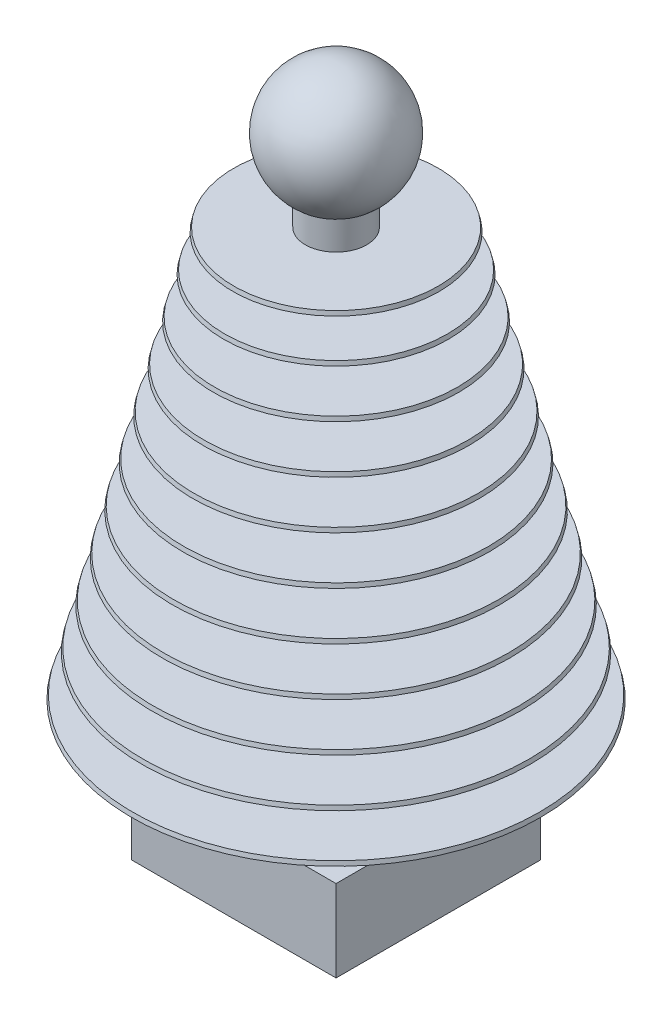
ISO-10303-21;
HEADER;
FILE_DESCRIPTION(('STEP AP214'),'2;1');
FILE_NAME('part.step','',(''),(''),'','','');
FILE_SCHEMA(('AUTOMOTIVE_DESIGN { 1 0 10303 214 1 1 1 1 }'));
ENDSEC;
DATA;
#1=APPLICATION_CONTEXT('core data for automotive mechanical design processes');
#2=APPLICATION_PROTOCOL_DEFINITION('international standard','automotive_design',2000,#1);
#3=PRODUCT_CONTEXT('',#1,'mechanical');
#4=PRODUCT('Part','Part','',(#3));
#5=PRODUCT_RELATED_PRODUCT_CATEGORY('part','',(#4));
#6=PRODUCT_DEFINITION_FORMATION('','',#4);
#7=PRODUCT_DEFINITION_CONTEXT('part definition',#1,'design');
#8=PRODUCT_DEFINITION('design','',#6,#7);
#9=PRODUCT_DEFINITION_SHAPE('','',#8);
#10=(LENGTH_UNIT() NAMED_UNIT(*) SI_UNIT(.MILLI.,.METRE.));
#11=(NAMED_UNIT(*) PLANE_ANGLE_UNIT() SI_UNIT($,.RADIAN.));
#12=(NAMED_UNIT(*) SI_UNIT($,.STERADIAN.) SOLID_ANGLE_UNIT());
#13=UNCERTAINTY_MEASURE_WITH_UNIT(LENGTH_MEASURE(1.E-05),#10,'distance_accuracy_value','');
#14=(GEOMETRIC_REPRESENTATION_CONTEXT(3) GLOBAL_UNCERTAINTY_ASSIGNED_CONTEXT((#13)) GLOBAL_UNIT_ASSIGNED_CONTEXT((#10,
#11,#12)) REPRESENTATION_CONTEXT('',''));
#15=CARTESIAN_POINT('',(0.,0.,0.));
#16=DIRECTION('',(0.,0.,1.));
#17=DIRECTION('',(1.,0.,0.));
#18=AXIS2_PLACEMENT_3D('',#15,#16,#17);
#19=CARTESIAN_POINT('',(0.,-64.,0.));
#20=DIRECTION('',(0.,1.,0.));
#21=DIRECTION('',(-1.,0.,0.));
#22=AXIS2_PLACEMENT_3D('',#19,#20,#21);
#23=CYLINDRICAL_SURFACE('',#22,7.5);
#24=CARTESIAN_POINT('',(0.,40.,0.));
#25=DIRECTION('',(0.,-1.,0.));
#26=DIRECTION('',(1.,0.,0.));
#27=AXIS2_PLACEMENT_3D('',#24,#25,#26);
#28=CIRCLE('',#27,7.5);
#29=CARTESIAN_POINT('',(7.49999999999999,40.,0.));
#30=VERTEX_POINT('',#29);
#31=EDGE_CURVE('E51',#30,#30,#28,.F.);
#32=ORIENTED_EDGE('',*,*,#31,.F.);
#33=EDGE_LOOP('',(#32));
#34=FACE_BOUND('',#33,.T.);
#35=CARTESIAN_POINT('',(0.,31.,0.));
#36=DIRECTION('',(0.,1.,0.));
#37=DIRECTION('',(-1.,0.,0.));
#38=AXIS2_PLACEMENT_3D('',#35,#36,#37);
#39=CIRCLE('',#38,7.5);
#40=CARTESIAN_POINT('',(-7.50000000000001,31.,0.));
#41=VERTEX_POINT('',#40);
#42=EDGE_CURVE('E286',#41,#41,#39,.F.);
#43=ORIENTED_EDGE('',*,*,#42,.F.);
#44=EDGE_LOOP('',(#43));
#45=FACE_BOUND('',#44,.T.);
#46=ADVANCED_FACE('F41',(#34,#45),#23,.T.);
#47=CARTESIAN_POINT('',(0.,20.,0.));
#48=DIRECTION('',(0.,-1.,0.));
#49=DIRECTION('',(1.,0.,0.));
#50=AXIS2_PLACEMENT_3D('',#47,#48,#49);
#51=CIRCLE('',#50,7.5);
#52=CARTESIAN_POINT('',(7.5,20.,0.));
#53=VERTEX_POINT('',#52);
#54=EDGE_CURVE('E294',#53,#53,#51,.F.);
#55=ORIENTED_EDGE('',*,*,#54,.F.);
#56=EDGE_LOOP('',(#55));
#57=FACE_BOUND('',#56,.T.);
#58=CARTESIAN_POINT('',(0.,11.,0.));
#59=DIRECTION('',(0.,1.,0.));
#60=DIRECTION('',(-1.,0.,0.));
#61=AXIS2_PLACEMENT_3D('',#58,#59,#60);
#62=CIRCLE('',#61,7.5);
#63=CARTESIAN_POINT('',(-7.5,11.,0.));
#64=VERTEX_POINT('',#63);
#65=EDGE_CURVE('E278',#64,#64,#62,.F.);
#66=ORIENTED_EDGE('',*,*,#65,.F.);
#67=EDGE_LOOP('',(#66));
#68=FACE_BOUND('',#67,.T.);
#69=ADVANCED_FACE('F314',(#57,#68),#23,.T.);
#70=CARTESIAN_POINT('',(0.,10.,0.));
#71=DIRECTION('',(0.,-1.,0.));
#72=DIRECTION('',(1.,0.,0.));
#73=AXIS2_PLACEMENT_3D('',#70,#71,#72);
#74=CIRCLE('',#73,7.5);
#75=CARTESIAN_POINT('',(7.5,10.,0.));
#76=VERTEX_POINT('',#75);
#77=EDGE_CURVE('E282',#76,#76,#74,.F.);
#78=ORIENTED_EDGE('',*,*,#77,.F.);
#79=EDGE_LOOP('',(#78));
#80=FACE_BOUND('',#79,.T.);
#81=CARTESIAN_POINT('',(0.,1.,0.));
#82=DIRECTION('',(0.,1.,0.));
#83=DIRECTION('',(-1.,0.,0.));
#84=AXIS2_PLACEMENT_3D('',#81,#82,#83);
#85=CIRCLE('',#84,7.5);
#86=CARTESIAN_POINT('',(-7.5,1.,0.));
#87=VERTEX_POINT('',#86);
#88=EDGE_CURVE('E270',#87,#87,#85,.F.);
#89=ORIENTED_EDGE('',*,*,#88,.F.);
#90=EDGE_LOOP('',(#89));
#91=FACE_BOUND('',#90,.T.);
#92=ADVANCED_FACE('F521',(#80,#91),#23,.T.);
#93=CARTESIAN_POINT('',(0.,0.,0.));
#94=DIRECTION('',(0.,-1.,0.));
#95=DIRECTION('',(1.,0.,0.));
#96=AXIS2_PLACEMENT_3D('',#93,#94,#95);
#97=CIRCLE('',#96,7.5);
#98=CARTESIAN_POINT('',(7.5,0.,0.));
#99=VERTEX_POINT('',#98);
#100=EDGE_CURVE('E274',#99,#99,#97,.F.);
#101=ORIENTED_EDGE('',*,*,#100,.F.);
#102=EDGE_LOOP('',(#101));
#103=FACE_BOUND('',#102,.T.);
#104=CARTESIAN_POINT('',(0.,-9.00000000000001,0.));
#105=DIRECTION('',(0.,1.,0.));
#106=DIRECTION('',(-1.,0.,0.));
#107=AXIS2_PLACEMENT_3D('',#104,#105,#106);
#108=CIRCLE('',#107,7.5);
#109=CARTESIAN_POINT('',(-7.5,-9.00000000000001,0.));
#110=VERTEX_POINT('',#109);
#111=EDGE_CURVE('E262',#110,#110,#108,.F.);
#112=ORIENTED_EDGE('',*,*,#111,.F.);
#113=EDGE_LOOP('',(#112));
#114=FACE_BOUND('',#113,.T.);
#115=ADVANCED_FACE('F508',(#103,#114),#23,.T.);
#116=CARTESIAN_POINT('',(0.,-10.,0.));
#117=DIRECTION('',(0.,-1.,0.));
#118=DIRECTION('',(1.,0.,0.));
#119=AXIS2_PLACEMENT_3D('',#116,#117,#118);
#120=CIRCLE('',#119,7.5);
#121=CARTESIAN_POINT('',(7.5,-10.,0.));
#122=VERTEX_POINT('',#121);
#123=EDGE_CURVE('E266',#122,#122,#120,.F.);
#124=ORIENTED_EDGE('',*,*,#123,.F.);
#125=EDGE_LOOP('',(#124));
#126=FACE_BOUND('',#125,.T.);
#127=CARTESIAN_POINT('',(0.,-19.,0.));
#128=DIRECTION('',(0.,1.,0.));
#129=DIRECTION('',(-1.,0.,0.));
#130=AXIS2_PLACEMENT_3D('',#127,#128,#129);
#131=CIRCLE('',#130,7.5);
#132=CARTESIAN_POINT('',(-7.5,-19.,0.));
#133=VERTEX_POINT('',#132);
#134=EDGE_CURVE('E254',#133,#133,#131,.F.);
#135=ORIENTED_EDGE('',*,*,#134,.F.);
#136=EDGE_LOOP('',(#135));
#137=FACE_BOUND('',#136,.T.);
#138=ADVANCED_FACE('F495',(#126,#137),#23,.T.);
#139=CARTESIAN_POINT('',(0.,-20.,0.));
#140=DIRECTION('',(0.,-1.,0.));
#141=DIRECTION('',(1.,0.,0.));
#142=AXIS2_PLACEMENT_3D('',#139,#140,#141);
#143=CIRCLE('',#142,7.5);
#144=CARTESIAN_POINT('',(7.5,-20.,0.));
#145=VERTEX_POINT('',#144);
#146=EDGE_CURVE('E258',#145,#145,#143,.F.);
#147=ORIENTED_EDGE('',*,*,#146,.F.);
#148=EDGE_LOOP('',(#147));
#149=FACE_BOUND('',#148,.T.);
#150=CARTESIAN_POINT('',(0.,-29.,0.));
#151=DIRECTION('',(0.,1.,0.));
#152=DIRECTION('',(-1.,0.,0.));
#153=AXIS2_PLACEMENT_3D('',#150,#151,#152);
#154=CIRCLE('',#153,7.5);
#155=CARTESIAN_POINT('',(-7.49999999999999,-29.,0.));
#156=VERTEX_POINT('',#155);
#157=EDGE_CURVE('E246',#156,#156,#154,.F.);
#158=ORIENTED_EDGE('',*,*,#157,.F.);
#159=EDGE_LOOP('',(#158));
#160=FACE_BOUND('',#159,.T.);
#161=ADVANCED_FACE('F479',(#149,#160),#23,.T.);
#162=CARTESIAN_POINT('',(0.,-30.,0.));
#163=DIRECTION('',(0.,-1.,0.));
#164=DIRECTION('',(1.,0.,0.));
#165=AXIS2_PLACEMENT_3D('',#162,#163,#164);
#166=CIRCLE('',#165,7.5);
#167=CARTESIAN_POINT('',(7.50000000000001,-30.,0.));
#168=VERTEX_POINT('',#167);
#169=EDGE_CURVE('E250',#168,#168,#166,.F.);
#170=ORIENTED_EDGE('',*,*,#169,.F.);
#171=EDGE_LOOP('',(#170));
#172=FACE_BOUND('',#171,.T.);
#173=CARTESIAN_POINT('',(0.,-39.,0.));
#174=DIRECTION('',(0.,1.,0.));
#175=DIRECTION('',(-1.,0.,0.));
#176=AXIS2_PLACEMENT_3D('',#173,#174,#175);
#177=CIRCLE('',#176,7.5);
#178=CARTESIAN_POINT('',(-7.49999999999999,-39.,0.));
#179=VERTEX_POINT('',#178);
#180=EDGE_CURVE('E238',#179,#179,#177,.F.);
#181=ORIENTED_EDGE('',*,*,#180,.F.);
#182=EDGE_LOOP('',(#181));
#183=FACE_BOUND('',#182,.T.);
#184=ADVANCED_FACE('F474',(#172,#183),#23,.T.);
#185=CARTESIAN_POINT('',(0.,-40.,0.));
#186=DIRECTION('',(0.,-1.,0.));
#187=DIRECTION('',(1.,0.,0.));
#188=AXIS2_PLACEMENT_3D('',#185,#186,#187);
#189=CIRCLE('',#188,7.5);
#190=CARTESIAN_POINT('',(7.50000000000001,-40.,0.));
#191=VERTEX_POINT('',#190);
#192=EDGE_CURVE('E242',#191,#191,#189,.F.);
#193=ORIENTED_EDGE('',*,*,#192,.F.);
#194=EDGE_LOOP('',(#193));
#195=FACE_BOUND('',#194,.T.);
#196=CARTESIAN_POINT('',(0.,-49.,0.));
#197=DIRECTION('',(0.,1.,0.));
#198=DIRECTION('',(-1.,0.,0.));
#199=AXIS2_PLACEMENT_3D('',#196,#197,#198);
#200=CIRCLE('',#199,7.5);
#201=CARTESIAN_POINT('',(-7.49999999999999,-49.,0.));
#202=VERTEX_POINT('',#201);
#203=EDGE_CURVE('E234',#202,#202,#200,.F.);
#204=ORIENTED_EDGE('',*,*,#203,.F.);
#205=EDGE_LOOP('',(#204));
#206=FACE_BOUND('',#205,.T.);
#207=ADVANCED_FACE('F427',(#195,#206),#23,.T.);
#208=CARTESIAN_POINT('',(0.,-49.,0.));
#209=DIRECTION('',(0.,1.,0.));
#210=DIRECTION('',(-1.,0.,0.));
#211=AXIS2_PLACEMENT_3D('',#208,#209,#210);
#212=PLANE('',#211);
#213=ORIENTED_EDGE('',*,*,#203,.T.);
#214=EDGE_LOOP('',(#213));
#215=FACE_BOUND('',#214,.T.);
#216=CARTESIAN_POINT('',(0.,-49.,0.));
#217=DIRECTION('',(0.,-1.,0.));
#218=DIRECTION('',(1.,0.,0.));
#219=AXIS2_PLACEMENT_3D('',#216,#217,#218);
#220=CIRCLE('',#219,49.75);
#221=CARTESIAN_POINT('',(49.75,-49.,0.));
#222=VERTEX_POINT('',#221);
#223=EDGE_CURVE('E207',#222,#222,#220,.T.);
#224=ORIENTED_EDGE('',*,*,#223,.F.);
#225=EDGE_LOOP('',(#224));
#226=FACE_BOUND('',#225,.T.);
#227=ADVANCED_FACE('F424',(#215,#226),#212,.T.);
#228=CARTESIAN_POINT('',(0.,-50.,0.));
#229=DIRECTION('',(0.,-1.,0.));
#230=DIRECTION('',(1.,0.,0.));
#231=AXIS2_PLACEMENT_3D('',#228,#229,#230);
#232=CONICAL_SURFACE('',#231,50.,0.244978663126849);
#233=ORIENTED_EDGE('',*,*,#223,.T.);
#234=EDGE_LOOP('',(#233));
#235=FACE_BOUND('',#234,.T.);
#236=CARTESIAN_POINT('',(0.,-50.,0.));
#237=DIRECTION('',(0.,-1.,0.));
#238=DIRECTION('',(1.,0.,0.));
#239=AXIS2_PLACEMENT_3D('',#236,#237,#238);
#240=CIRCLE('',#239,50.);
#241=CARTESIAN_POINT('',(50.,-50.,0.));
#242=VERTEX_POINT('',#241);
#243=EDGE_CURVE('E203',#242,#242,#240,.T.);
#244=ORIENTED_EDGE('',*,*,#243,.F.);
#245=EDGE_LOOP('',(#244));
#246=FACE_BOUND('',#245,.T.);
#247=ADVANCED_FACE('F420',(#235,#246),#232,.T.);
#248=CARTESIAN_POINT('',(50.,-50.,0.));
#249=DIRECTION('',(0.,-1.,0.));
#250=DIRECTION('',(1.,0.,0.));
#251=AXIS2_PLACEMENT_3D('',#248,#249,#250);
#252=PLANE('',#251);
#253=CARTESIAN_POINT('',(0.,-50.,0.));
#254=DIRECTION('',(0.,-1.,0.));
#255=DIRECTION('',(1.,0.,0.));
#256=AXIS2_PLACEMENT_3D('',#253,#254,#255);
#257=CIRCLE('',#256,7.5);
#258=CARTESIAN_POINT('',(7.50000000000001,-50.,0.));
#259=VERTEX_POINT('',#258);
#260=EDGE_CURVE('E219',#259,#259,#257,.F.);
#261=ORIENTED_EDGE('',*,*,#260,.T.);
#262=EDGE_LOOP('',(#261));
#263=FACE_BOUND('',#262,.T.);
#264=ORIENTED_EDGE('',*,*,#243,.T.);
#265=EDGE_LOOP('',(#264));
#266=FACE_BOUND('',#265,.T.);
#267=ADVANCED_FACE('F417',(#263,#266),#252,.T.);
#268=ORIENTED_EDGE('',*,*,#260,.F.);
#269=EDGE_LOOP('',(#268));
#270=FACE_BOUND('',#269,.T.);
#271=CARTESIAN_POINT('',(0.,-64.,0.));
#272=DIRECTION('',(0.,1.,0.));
#273=DIRECTION('',(-1.,0.,0.));
#274=AXIS2_PLACEMENT_3D('',#271,#272,#273);
#275=CIRCLE('',#274,7.5);
#276=CARTESIAN_POINT('',(-7.49999999999999,-64.,0.));
#277=VERTEX_POINT('',#276);
#278=EDGE_CURVE('E130',#277,#277,#275,.T.);
#279=ORIENTED_EDGE('',*,*,#278,.T.);
#280=EDGE_LOOP('',(#279));
#281=FACE_BOUND('',#280,.T.);
#282=ADVANCED_FACE('F317',(#270,#281),#23,.T.);
#283=CARTESIAN_POINT('',(0.,-40.,0.));
#284=DIRECTION('',(0.,-1.,0.));
#285=DIRECTION('',(1.,0.,0.));
#286=AXIS2_PLACEMENT_3D('',#283,#284,#285);
#287=CONICAL_SURFACE('',#286,47.5,0.244978663126863);
#288=CARTESIAN_POINT('',(0.,-39.,0.));
#289=DIRECTION('',(0.,-1.,0.));
#290=DIRECTION('',(1.,0.,0.));
#291=AXIS2_PLACEMENT_3D('',#288,#289,#290);
#292=CIRCLE('',#291,47.25);
#293=CARTESIAN_POINT('',(47.25,-39.,0.));
#294=VERTEX_POINT('',#293);
#295=EDGE_CURVE('E195',#294,#294,#292,.T.);
#296=ORIENTED_EDGE('',*,*,#295,.T.);
#297=EDGE_LOOP('',(#296));
#298=FACE_BOUND('',#297,.T.);
#299=CARTESIAN_POINT('',(0.,-40.,0.));
#300=DIRECTION('',(0.,-1.,0.));
#301=DIRECTION('',(1.,0.,0.));
#302=AXIS2_PLACEMENT_3D('',#299,#300,#301);
#303=CIRCLE('',#302,47.5);
#304=CARTESIAN_POINT('',(47.5,-40.,0.));
#305=VERTEX_POINT('',#304);
#306=EDGE_CURVE('E199',#305,#305,#303,.T.);
#307=ORIENTED_EDGE('',*,*,#306,.F.);
#308=EDGE_LOOP('',(#307));
#309=FACE_BOUND('',#308,.T.);
#310=ADVANCED_FACE('F412',(#298,#309),#287,.T.);
#311=CARTESIAN_POINT('',(47.5,-40.,0.));
#312=DIRECTION('',(0.,-1.,0.));
#313=DIRECTION('',(1.,0.,0.));
#314=AXIS2_PLACEMENT_3D('',#311,#312,#313);
#315=PLANE('',#314);
#316=ORIENTED_EDGE('',*,*,#192,.T.);
#317=EDGE_LOOP('',(#316));
#318=FACE_BOUND('',#317,.T.);
#319=ORIENTED_EDGE('',*,*,#306,.T.);
#320=EDGE_LOOP('',(#319));
#321=FACE_BOUND('',#320,.T.);
#322=ADVANCED_FACE('F408',(#318,#321),#315,.T.);
#323=CARTESIAN_POINT('',(0.,-39.,0.));
#324=DIRECTION('',(0.,1.,0.));
#325=DIRECTION('',(-1.,0.,0.));
#326=AXIS2_PLACEMENT_3D('',#323,#324,#325);
#327=PLANE('',#326);
#328=ORIENTED_EDGE('',*,*,#180,.T.);
#329=EDGE_LOOP('',(#328));
#330=FACE_BOUND('',#329,.T.);
#331=ORIENTED_EDGE('',*,*,#295,.F.);
#332=EDGE_LOOP('',(#331));
#333=FACE_BOUND('',#332,.T.);
#334=ADVANCED_FACE('F404',(#330,#333),#327,.T.);
#335=CARTESIAN_POINT('',(0.,-30.,0.));
#336=DIRECTION('',(0.,-1.,0.));
#337=DIRECTION('',(1.,0.,0.));
#338=AXIS2_PLACEMENT_3D('',#335,#336,#337);
#339=CONICAL_SURFACE('',#338,45.,0.244978663126863);
#340=CARTESIAN_POINT('',(0.,-29.,0.));
#341=DIRECTION('',(0.,-1.,0.));
#342=DIRECTION('',(1.,0.,0.));
#343=AXIS2_PLACEMENT_3D('',#340,#341,#342);
#344=CIRCLE('',#343,44.75);
#345=CARTESIAN_POINT('',(44.75,-29.,0.));
#346=VERTEX_POINT('',#345);
#347=EDGE_CURVE('E187',#346,#346,#344,.T.);
#348=ORIENTED_EDGE('',*,*,#347,.T.);
#349=EDGE_LOOP('',(#348));
#350=FACE_BOUND('',#349,.T.);
#351=CARTESIAN_POINT('',(0.,-30.,0.));
#352=DIRECTION('',(0.,-1.,0.));
#353=DIRECTION('',(1.,0.,0.));
#354=AXIS2_PLACEMENT_3D('',#351,#352,#353);
#355=CIRCLE('',#354,45.);
#356=CARTESIAN_POINT('',(45.,-30.,0.));
#357=VERTEX_POINT('',#356);
#358=EDGE_CURVE('E191',#357,#357,#355,.T.);
#359=ORIENTED_EDGE('',*,*,#358,.F.);
#360=EDGE_LOOP('',(#359));
#361=FACE_BOUND('',#360,.T.);
#362=ADVANCED_FACE('F400',(#350,#361),#339,.T.);
#363=CARTESIAN_POINT('',(45.,-30.,0.));
#364=DIRECTION('',(0.,-1.,0.));
#365=DIRECTION('',(1.,0.,0.));
#366=AXIS2_PLACEMENT_3D('',#363,#364,#365);
#367=PLANE('',#366);
#368=ORIENTED_EDGE('',*,*,#169,.T.);
#369=EDGE_LOOP('',(#368));
#370=FACE_BOUND('',#369,.T.);
#371=ORIENTED_EDGE('',*,*,#358,.T.);
#372=EDGE_LOOP('',(#371));
#373=FACE_BOUND('',#372,.T.);
#374=ADVANCED_FACE('F396',(#370,#373),#367,.T.);
#375=CARTESIAN_POINT('',(0.,-29.,0.));
#376=DIRECTION('',(0.,1.,0.));
#377=DIRECTION('',(-1.,0.,0.));
#378=AXIS2_PLACEMENT_3D('',#375,#376,#377);
#379=PLANE('',#378);
#380=ORIENTED_EDGE('',*,*,#157,.T.);
#381=EDGE_LOOP('',(#380));
#382=FACE_BOUND('',#381,.T.);
#383=ORIENTED_EDGE('',*,*,#347,.F.);
#384=EDGE_LOOP('',(#383));
#385=FACE_BOUND('',#384,.T.);
#386=ADVANCED_FACE('F392',(#382,#385),#379,.T.);
#387=CARTESIAN_POINT('',(0.,-20.,0.));
#388=DIRECTION('',(0.,-1.,0.));
#389=DIRECTION('',(1.,0.,0.));
#390=AXIS2_PLACEMENT_3D('',#387,#388,#389);
#391=CONICAL_SURFACE('',#390,42.5,0.244978663126864);
#392=CARTESIAN_POINT('',(0.,-19.,0.));
#393=DIRECTION('',(0.,-1.,0.));
#394=DIRECTION('',(1.,0.,0.));
#395=AXIS2_PLACEMENT_3D('',#392,#393,#394);
#396=CIRCLE('',#395,42.25);
#397=CARTESIAN_POINT('',(42.25,-19.,0.));
#398=VERTEX_POINT('',#397);
#399=EDGE_CURVE('E179',#398,#398,#396,.T.);
#400=ORIENTED_EDGE('',*,*,#399,.T.);
#401=EDGE_LOOP('',(#400));
#402=FACE_BOUND('',#401,.T.);
#403=CARTESIAN_POINT('',(0.,-20.,0.));
#404=DIRECTION('',(0.,-1.,0.));
#405=DIRECTION('',(1.,0.,0.));
#406=AXIS2_PLACEMENT_3D('',#403,#404,#405);
#407=CIRCLE('',#406,42.5);
#408=CARTESIAN_POINT('',(42.5,-20.,0.));
#409=VERTEX_POINT('',#408);
#410=EDGE_CURVE('E183',#409,#409,#407,.T.);
#411=ORIENTED_EDGE('',*,*,#410,.F.);
#412=EDGE_LOOP('',(#411));
#413=FACE_BOUND('',#412,.T.);
#414=ADVANCED_FACE('F388',(#402,#413),#391,.T.);
#415=CARTESIAN_POINT('',(42.5,-20.,0.));
#416=DIRECTION('',(0.,-1.,0.));
#417=DIRECTION('',(1.,0.,0.));
#418=AXIS2_PLACEMENT_3D('',#415,#416,#417);
#419=PLANE('',#418);
#420=ORIENTED_EDGE('',*,*,#146,.T.);
#421=EDGE_LOOP('',(#420));
#422=FACE_BOUND('',#421,.T.);
#423=ORIENTED_EDGE('',*,*,#410,.T.);
#424=EDGE_LOOP('',(#423));
#425=FACE_BOUND('',#424,.T.);
#426=ADVANCED_FACE('F384',(#422,#425),#419,.T.);
#427=CARTESIAN_POINT('',(-1.02907469966573E-13,-19.,0.));
#428=DIRECTION('',(0.,1.,0.));
#429=DIRECTION('',(-1.,0.,0.));
#430=AXIS2_PLACEMENT_3D('',#427,#428,#429);
#431=PLANE('',#430);
#432=ORIENTED_EDGE('',*,*,#134,.T.);
#433=EDGE_LOOP('',(#432));
#434=FACE_BOUND('',#433,.T.);
#435=ORIENTED_EDGE('',*,*,#399,.F.);
#436=EDGE_LOOP('',(#435));
#437=FACE_BOUND('',#436,.T.);
#438=ADVANCED_FACE('F380',(#434,#437),#431,.T.);
#439=CARTESIAN_POINT('',(0.,-9.99999999999999,0.));
#440=DIRECTION('',(0.,-1.,0.));
#441=DIRECTION('',(1.,0.,0.));
#442=AXIS2_PLACEMENT_3D('',#439,#440,#441);
#443=CONICAL_SURFACE('',#442,40.,0.244978663126867);
#444=CARTESIAN_POINT('',(0.,-9.00000000000001,0.));
#445=DIRECTION('',(0.,-1.,0.));
#446=DIRECTION('',(1.,0.,0.));
#447=AXIS2_PLACEMENT_3D('',#444,#445,#446);
#448=CIRCLE('',#447,39.75);
#449=CARTESIAN_POINT('',(39.75,-9.,0.));
#450=VERTEX_POINT('',#449);
#451=EDGE_CURVE('E171',#450,#450,#448,.T.);
#452=ORIENTED_EDGE('',*,*,#451,.T.);
#453=EDGE_LOOP('',(#452));
#454=FACE_BOUND('',#453,.T.);
#455=CARTESIAN_POINT('',(0.,-9.99999999999999,0.));
#456=DIRECTION('',(0.,-1.,0.));
#457=DIRECTION('',(1.,0.,0.));
#458=AXIS2_PLACEMENT_3D('',#455,#456,#457);
#459=CIRCLE('',#458,40.);
#460=CARTESIAN_POINT('',(40.,-9.99999999999999,0.));
#461=VERTEX_POINT('',#460);
#462=EDGE_CURVE('E175',#461,#461,#459,.T.);
#463=ORIENTED_EDGE('',*,*,#462,.F.);
#464=EDGE_LOOP('',(#463));
#465=FACE_BOUND('',#464,.T.);
#466=ADVANCED_FACE('F376',(#454,#465),#443,.T.);
#467=CARTESIAN_POINT('',(40.,-9.99999999999999,0.));
#468=DIRECTION('',(0.,-1.,0.));
#469=DIRECTION('',(1.,0.,0.));
#470=AXIS2_PLACEMENT_3D('',#467,#468,#469);
#471=PLANE('',#470);
#472=ORIENTED_EDGE('',*,*,#123,.T.);
#473=EDGE_LOOP('',(#472));
#474=FACE_BOUND('',#473,.T.);
#475=ORIENTED_EDGE('',*,*,#462,.T.);
#476=EDGE_LOOP('',(#475));
#477=FACE_BOUND('',#476,.T.);
#478=ADVANCED_FACE('F372',(#474,#477),#471,.T.);
#479=CARTESIAN_POINT('',(-1.37209959955431E-13,-9.00000000000001,0.));
#480=DIRECTION('',(0.,1.,0.));
#481=DIRECTION('',(-1.,0.,0.));
#482=AXIS2_PLACEMENT_3D('',#479,#480,#481);
#483=PLANE('',#482);
#484=ORIENTED_EDGE('',*,*,#111,.T.);
#485=EDGE_LOOP('',(#484));
#486=FACE_BOUND('',#485,.T.);
#487=ORIENTED_EDGE('',*,*,#451,.F.);
#488=EDGE_LOOP('',(#487));
#489=FACE_BOUND('',#488,.T.);
#490=ADVANCED_FACE('F368',(#486,#489),#483,.T.);
#491=CARTESIAN_POINT('',(0.,0.,0.));
#492=DIRECTION('',(0.,-1.,0.));
#493=DIRECTION('',(1.,0.,0.));
#494=AXIS2_PLACEMENT_3D('',#491,#492,#493);
#495=CONICAL_SURFACE('',#494,37.5,0.244978663126867);
#496=CARTESIAN_POINT('',(0.,0.999999999999994,0.));
#497=DIRECTION('',(0.,-1.,0.));
#498=DIRECTION('',(1.,0.,0.));
#499=AXIS2_PLACEMENT_3D('',#496,#497,#498);
#500=CIRCLE('',#499,37.25);
#501=CARTESIAN_POINT('',(37.25,1.,0.));
#502=VERTEX_POINT('',#501);
#503=EDGE_CURVE('E163',#502,#502,#500,.T.);
#504=ORIENTED_EDGE('',*,*,#503,.T.);
#505=EDGE_LOOP('',(#504));
#506=FACE_BOUND('',#505,.T.);
#507=CARTESIAN_POINT('',(0.,0.,0.));
#508=DIRECTION('',(0.,-1.,0.));
#509=DIRECTION('',(1.,0.,0.));
#510=AXIS2_PLACEMENT_3D('',#507,#508,#509);
#511=CIRCLE('',#510,37.5);
#512=CARTESIAN_POINT('',(37.5,0.,0.));
#513=VERTEX_POINT('',#512);
#514=EDGE_CURVE('E167',#513,#513,#511,.T.);
#515=ORIENTED_EDGE('',*,*,#514,.F.);
#516=EDGE_LOOP('',(#515));
#517=FACE_BOUND('',#516,.T.);
#518=ADVANCED_FACE('F364',(#506,#517),#495,.T.);
#519=CARTESIAN_POINT('',(37.5,0.,0.));
#520=DIRECTION('',(0.,-1.,0.));
#521=DIRECTION('',(1.,0.,0.));
#522=AXIS2_PLACEMENT_3D('',#519,#520,#521);
#523=PLANE('',#522);
#524=ORIENTED_EDGE('',*,*,#100,.T.);
#525=EDGE_LOOP('',(#524));
#526=FACE_BOUND('',#525,.T.);
#527=ORIENTED_EDGE('',*,*,#514,.T.);
#528=EDGE_LOOP('',(#527));
#529=FACE_BOUND('',#528,.T.);
#530=ADVANCED_FACE('F360',(#526,#529),#523,.T.);
#531=CARTESIAN_POINT('',(-1.71512449944288E-13,0.999999999999997,0.));
#532=DIRECTION('',(0.,1.,0.));
#533=DIRECTION('',(-1.,0.,0.));
#534=AXIS2_PLACEMENT_3D('',#531,#532,#533);
#535=PLANE('',#534);
#536=ORIENTED_EDGE('',*,*,#88,.T.);
#537=EDGE_LOOP('',(#536));
#538=FACE_BOUND('',#537,.T.);
#539=ORIENTED_EDGE('',*,*,#503,.F.);
#540=EDGE_LOOP('',(#539));
#541=FACE_BOUND('',#540,.T.);
#542=ADVANCED_FACE('F356',(#538,#541),#535,.T.);
#543=CARTESIAN_POINT('',(0.,10.,0.));
#544=DIRECTION('',(0.,-1.,0.));
#545=DIRECTION('',(1.,0.,0.));
#546=AXIS2_PLACEMENT_3D('',#543,#544,#545);
#547=CONICAL_SURFACE('',#546,35.,0.244978663126867);
#548=CARTESIAN_POINT('',(0.,11.,0.));
#549=DIRECTION('',(0.,-1.,0.));
#550=DIRECTION('',(1.,0.,0.));
#551=AXIS2_PLACEMENT_3D('',#548,#549,#550);
#552=CIRCLE('',#551,34.75);
#553=CARTESIAN_POINT('',(34.75,11.,0.));
#554=VERTEX_POINT('',#553);
#555=EDGE_CURVE('E155',#554,#554,#552,.T.);
#556=ORIENTED_EDGE('',*,*,#555,.T.);
#557=EDGE_LOOP('',(#556));
#558=FACE_BOUND('',#557,.T.);
#559=CARTESIAN_POINT('',(0.,10.,0.));
#560=DIRECTION('',(0.,-1.,0.));
#561=DIRECTION('',(1.,0.,0.));
#562=AXIS2_PLACEMENT_3D('',#559,#560,#561);
#563=CIRCLE('',#562,35.);
#564=CARTESIAN_POINT('',(35.,10.,0.));
#565=VERTEX_POINT('',#564);
#566=EDGE_CURVE('E159',#565,#565,#563,.T.);
#567=ORIENTED_EDGE('',*,*,#566,.F.);
#568=EDGE_LOOP('',(#567));
#569=FACE_BOUND('',#568,.T.);
#570=ADVANCED_FACE('F352',(#558,#569),#547,.T.);
#571=CARTESIAN_POINT('',(35.,10.,0.));
#572=DIRECTION('',(0.,-1.,0.));
#573=DIRECTION('',(1.,0.,0.));
#574=AXIS2_PLACEMENT_3D('',#571,#572,#573);
#575=PLANE('',#574);
#576=ORIENTED_EDGE('',*,*,#77,.T.);
#577=EDGE_LOOP('',(#576));
#578=FACE_BOUND('',#577,.T.);
#579=ORIENTED_EDGE('',*,*,#566,.T.);
#580=EDGE_LOOP('',(#579));
#581=FACE_BOUND('',#580,.T.);
#582=ADVANCED_FACE('F348',(#578,#581),#575,.T.);
#583=CARTESIAN_POINT('',(-2.05814939933146E-13,11.,0.));
#584=DIRECTION('',(0.,1.,0.));
#585=DIRECTION('',(-1.,0.,0.));
#586=AXIS2_PLACEMENT_3D('',#583,#584,#585);
#587=PLANE('',#586);
#588=ORIENTED_EDGE('',*,*,#65,.T.);
#589=EDGE_LOOP('',(#588));
#590=FACE_BOUND('',#589,.T.);
#591=ORIENTED_EDGE('',*,*,#555,.F.);
#592=EDGE_LOOP('',(#591));
#593=FACE_BOUND('',#592,.T.);
#594=ADVANCED_FACE('F344',(#590,#593),#587,.T.);
#595=CARTESIAN_POINT('',(-2.40117429922004E-13,21.,0.));
#596=DIRECTION('',(0.,1.,0.));
#597=DIRECTION('',(-1.,0.,0.));
#598=AXIS2_PLACEMENT_3D('',#595,#596,#597);
#599=PLANE('',#598);
#600=CARTESIAN_POINT('',(0.,21.,0.));
#601=DIRECTION('',(0.,1.,0.));
#602=DIRECTION('',(-1.,0.,0.));
#603=AXIS2_PLACEMENT_3D('',#600,#601,#602);
#604=CIRCLE('',#603,7.5);
#605=CARTESIAN_POINT('',(-7.5,21.,0.));
#606=VERTEX_POINT('',#605);
#607=EDGE_CURVE('E298',#606,#606,#604,.F.);
#608=ORIENTED_EDGE('',*,*,#607,.T.);
#609=EDGE_LOOP('',(#608));
#610=FACE_BOUND('',#609,.T.);
#611=CARTESIAN_POINT('',(0.,21.,0.));
#612=DIRECTION('',(0.,-1.,0.));
#613=DIRECTION('',(1.,0.,0.));
#614=AXIS2_PLACEMENT_3D('',#611,#612,#613);
#615=CIRCLE('',#614,32.25);
#616=CARTESIAN_POINT('',(32.25,21.,0.));
#617=VERTEX_POINT('',#616);
#618=EDGE_CURVE('E143',#617,#617,#615,.T.);
#619=ORIENTED_EDGE('',*,*,#618,.F.);
#620=EDGE_LOOP('',(#619));
#621=FACE_BOUND('',#620,.T.);
#622=ADVANCED_FACE('F347',(#610,#621),#599,.T.);
#623=CARTESIAN_POINT('',(0.,20.,0.));
#624=DIRECTION('',(0.,-1.,0.));
#625=DIRECTION('',(1.,0.,0.));
#626=AXIS2_PLACEMENT_3D('',#623,#624,#625);
#627=CONICAL_SURFACE('',#626,32.5,0.244978663126874);
#628=ORIENTED_EDGE('',*,*,#618,.T.);
#629=EDGE_LOOP('',(#628));
#630=FACE_BOUND('',#629,.T.);
#631=CARTESIAN_POINT('',(0.,20.,0.));
#632=DIRECTION('',(0.,-1.,0.));
#633=DIRECTION('',(1.,0.,0.));
#634=AXIS2_PLACEMENT_3D('',#631,#632,#633);
#635=CIRCLE('',#634,32.5);
#636=CARTESIAN_POINT('',(32.5,20.,0.));
#637=VERTEX_POINT('',#636);
#638=EDGE_CURVE('E139',#637,#637,#635,.T.);
#639=ORIENTED_EDGE('',*,*,#638,.F.);
#640=EDGE_LOOP('',(#639));
#641=FACE_BOUND('',#640,.T.);
#642=ADVANCED_FACE('F565',(#630,#641),#627,.T.);
#643=CARTESIAN_POINT('',(32.5,20.,0.));
#644=DIRECTION('',(0.,-1.,0.));
#645=DIRECTION('',(1.,0.,0.));
#646=AXIS2_PLACEMENT_3D('',#643,#644,#645);
#647=PLANE('',#646);
#648=ORIENTED_EDGE('',*,*,#54,.T.);
#649=EDGE_LOOP('',(#648));
#650=FACE_BOUND('',#649,.T.);
#651=ORIENTED_EDGE('',*,*,#638,.T.);
#652=EDGE_LOOP('',(#651));
#653=FACE_BOUND('',#652,.T.);
#654=ADVANCED_FACE('F324',(#650,#653),#647,.T.);
#655=CARTESIAN_POINT('',(-2.74419919910861E-13,31.,0.));
#656=DIRECTION('',(0.,1.,0.));
#657=DIRECTION('',(-1.,0.,0.));
#658=AXIS2_PLACEMENT_3D('',#655,#656,#657);
#659=PLANE('',#658);
#660=ORIENTED_EDGE('',*,*,#42,.T.);
#661=EDGE_LOOP('',(#660));
#662=FACE_BOUND('',#661,.T.);
#663=CARTESIAN_POINT('',(0.,31.,0.));
#664=DIRECTION('',(0.,-1.,0.));
#665=DIRECTION('',(1.,0.,0.));
#666=AXIS2_PLACEMENT_3D('',#663,#664,#665);
#667=CIRCLE('',#666,29.75);
#668=CARTESIAN_POINT('',(29.75,31.,0.));
#669=VERTEX_POINT('',#668);
#670=EDGE_CURVE('E147',#669,#669,#667,.T.);
#671=ORIENTED_EDGE('',*,*,#670,.F.);
#672=EDGE_LOOP('',(#671));
#673=FACE_BOUND('',#672,.T.);
#674=ADVANCED_FACE('F320',(#662,#673),#659,.T.);
#675=CARTESIAN_POINT('',(0.,30.,0.));
#676=DIRECTION('',(0.,-1.,0.));
#677=DIRECTION('',(1.,0.,0.));
#678=AXIS2_PLACEMENT_3D('',#675,#676,#677);
#679=CONICAL_SURFACE('',#678,30.,0.244978663126871);
#680=ORIENTED_EDGE('',*,*,#670,.T.);
#681=EDGE_LOOP('',(#680));
#682=FACE_BOUND('',#681,.T.);
#683=CARTESIAN_POINT('',(0.,30.,0.));
#684=DIRECTION('',(0.,-1.,0.));
#685=DIRECTION('',(1.,0.,0.));
#686=AXIS2_PLACEMENT_3D('',#683,#684,#685);
#687=CIRCLE('',#686,30.);
#688=CARTESIAN_POINT('',(30.,30.,0.));
#689=VERTEX_POINT('',#688);
#690=EDGE_CURVE('E151',#689,#689,#687,.T.);
#691=ORIENTED_EDGE('',*,*,#690,.F.);
#692=EDGE_LOOP('',(#691));
#693=FACE_BOUND('',#692,.T.);
#694=ADVANCED_FACE('F323',(#682,#693),#679,.T.);
#695=CARTESIAN_POINT('',(30.,30.,0.));
#696=DIRECTION('',(0.,-1.,0.));
#697=DIRECTION('',(1.,0.,0.));
#698=AXIS2_PLACEMENT_3D('',#695,#696,#697);
#699=PLANE('',#698);
#700=CARTESIAN_POINT('',(0.,30.,0.));
#701=DIRECTION('',(0.,-1.,0.));
#702=DIRECTION('',(1.,0.,0.));
#703=AXIS2_PLACEMENT_3D('',#700,#701,#702);
#704=CIRCLE('',#703,7.5);
#705=CARTESIAN_POINT('',(7.49999999999999,30.,0.));
#706=VERTEX_POINT('',#705);
#707=EDGE_CURVE('E290',#706,#706,#704,.F.);
#708=ORIENTED_EDGE('',*,*,#707,.T.);
#709=EDGE_LOOP('',(#708));
#710=FACE_BOUND('',#709,.T.);
#711=ORIENTED_EDGE('',*,*,#690,.T.);
#712=EDGE_LOOP('',(#711));
#713=FACE_BOUND('',#712,.T.);
#714=ADVANCED_FACE('F330',(#710,#713),#699,.T.);
#715=ORIENTED_EDGE('',*,*,#607,.F.);
#716=EDGE_LOOP('',(#715));
#717=FACE_BOUND('',#716,.T.);
#718=ORIENTED_EDGE('',*,*,#707,.F.);
#719=EDGE_LOOP('',(#718));
#720=FACE_BOUND('',#719,.T.);
#721=ADVANCED_FACE('F316',(#717,#720),#23,.T.);
#722=CARTESIAN_POINT('',(0.,39.9999999999999,0.));
#723=DIRECTION('',(0.,-1.,0.));
#724=DIRECTION('',(1.,0.,0.));
#725=AXIS2_PLACEMENT_3D('',#722,#723,#724);
#726=CONICAL_SURFACE('',#725,27.5,0.244978663126864);
#727=CARTESIAN_POINT('',(0.,41.,0.));
#728=DIRECTION('',(0.,-1.,0.));
#729=DIRECTION('',(1.,0.,0.));
#730=AXIS2_PLACEMENT_3D('',#727,#728,#729);
#731=CIRCLE('',#730,27.25);
#732=CARTESIAN_POINT('',(27.25,41.,0.));
#733=VERTEX_POINT('',#732);
#734=EDGE_CURVE('E131',#733,#733,#731,.T.);
#735=ORIENTED_EDGE('',*,*,#734,.T.);
#736=EDGE_LOOP('',(#735));
#737=FACE_BOUND('',#736,.T.);
#738=CARTESIAN_POINT('',(0.,39.9999999999999,0.));
#739=DIRECTION('',(0.,-1.,0.));
#740=DIRECTION('',(1.,0.,0.));
#741=AXIS2_PLACEMENT_3D('',#738,#739,#740);
#742=CIRCLE('',#741,27.5);
#743=CARTESIAN_POINT('',(27.5,39.9999999999999,0.));
#744=VERTEX_POINT('',#743);
#745=EDGE_CURVE('E135',#744,#744,#742,.T.);
#746=ORIENTED_EDGE('',*,*,#745,.F.);
#747=EDGE_LOOP('',(#746));
#748=FACE_BOUND('',#747,.T.);
#749=ADVANCED_FACE('F340',(#737,#748),#726,.T.);
#750=CARTESIAN_POINT('',(27.5,40.,0.));
#751=DIRECTION('',(0.,-1.,0.));
#752=DIRECTION('',(1.,0.,0.));
#753=AXIS2_PLACEMENT_3D('',#750,#751,#752);
#754=PLANE('',#753);
#755=ORIENTED_EDGE('',*,*,#31,.T.);
#756=EDGE_LOOP('',(#755));
#757=FACE_BOUND('',#756,.T.);
#758=ORIENTED_EDGE('',*,*,#745,.T.);
#759=EDGE_LOOP('',(#758));
#760=FACE_BOUND('',#759,.T.);
#761=ADVANCED_FACE('F309',(#757,#760),#754,.T.);
#762=CARTESIAN_POINT('',(-3.08722409899719E-13,41.,0.));
#763=DIRECTION('',(0.,1.,0.));
#764=DIRECTION('',(-1.,0.,0.));
#765=AXIS2_PLACEMENT_3D('',#762,#763,#764);
#766=PLANE('',#765);
#767=CARTESIAN_POINT('',(0.,41.,0.));
#768=DIRECTION('',(0.,1.,0.));
#769=DIRECTION('',(-1.,0.,0.));
#770=AXIS2_PLACEMENT_3D('',#767,#768,#769);
#771=CIRCLE('',#770,7.5);
#772=CARTESIAN_POINT('',(-7.50000000000001,41.,0.));
#773=VERTEX_POINT('',#772);
#774=EDGE_CURVE('E302',#773,#773,#771,.F.);
#775=ORIENTED_EDGE('',*,*,#774,.T.);
#776=EDGE_LOOP('',(#775));
#777=FACE_BOUND('',#776,.T.);
#778=ORIENTED_EDGE('',*,*,#734,.F.);
#779=EDGE_LOOP('',(#778));
#780=FACE_BOUND('',#779,.T.);
#781=ADVANCED_FACE('F452',(#777,#780),#766,.T.);
#782=CARTESIAN_POINT('',(0.,57.0096189432334,0.));
#783=DIRECTION('',(0.,1.,0.));
#784=DIRECTION('',(-1.,0.,0.));
#785=AXIS2_PLACEMENT_3D('',#782,#783,#784);
#786=CIRCLE('',#785,7.5);
#787=CARTESIAN_POINT('',(-7.50000000000001,57.0096189432334,0.));
#788=VERTEX_POINT('',#787);
#789=EDGE_CURVE('E12',#788,#788,#786,.T.);
#790=ORIENTED_EDGE('',*,*,#789,.F.);
#791=EDGE_LOOP('',(#790));
#792=FACE_BOUND('',#791,.T.);
#793=CARTESIAN_POINT('',(0.,50.,0.));
#794=DIRECTION('',(0.,1.,0.));
#795=DIRECTION('',(-1.,0.,0.));
#796=AXIS2_PLACEMENT_3D('',#793,#794,#795);
#797=CIRCLE('',#796,7.5);
#798=CARTESIAN_POINT('',(-7.50000000000001,50.,0.));
#799=VERTEX_POINT('',#798);
#800=EDGE_CURVE('E215',#799,#799,#797,.T.);
#801=ORIENTED_EDGE('',*,*,#800,.T.);
#802=EDGE_LOOP('',(#801));
#803=FACE_BOUND('',#802,.T.);
#804=ADVANCED_FACE('F432',(#792,#803),#23,.T.);
#805=CARTESIAN_POINT('',(0.,50.,0.));
#806=DIRECTION('',(0.,1.,0.));
#807=DIRECTION('',(-1.,0.,0.));
#808=AXIS2_PLACEMENT_3D('',#805,#806,#807);
#809=PLANE('',#808);
#810=ORIENTED_EDGE('',*,*,#800,.F.);
#811=EDGE_LOOP('',(#810));
#812=FACE_BOUND('',#811,.T.);
#813=CARTESIAN_POINT('',(0.,50.,0.));
#814=DIRECTION('',(0.,-1.,0.));
#815=DIRECTION('',(1.,0.,0.));
#816=AXIS2_PLACEMENT_3D('',#813,#814,#815);
#817=CIRCLE('',#816,25.);
#818=CARTESIAN_POINT('',(25.,50.,0.));
#819=VERTEX_POINT('',#818);
#820=EDGE_CURVE('E224',#819,#819,#817,.T.);
#821=ORIENTED_EDGE('',*,*,#820,.F.);
#822=EDGE_LOOP('',(#821));
#823=FACE_BOUND('',#822,.T.);
#824=ADVANCED_FACE('F43',(#812,#823),#809,.T.);
#825=CARTESIAN_POINT('',(0.,49.,0.));
#826=DIRECTION('',(0.,-1.,0.));
#827=DIRECTION('',(1.,0.,0.));
#828=AXIS2_PLACEMENT_3D('',#825,#826,#827);
#829=CONICAL_SURFACE('',#828,25.25,0.244978663126864);
#830=ORIENTED_EDGE('',*,*,#820,.T.);
#831=EDGE_LOOP('',(#830));
#832=FACE_BOUND('',#831,.T.);
#833=CARTESIAN_POINT('',(0.,49.,0.));
#834=DIRECTION('',(0.,-1.,0.));
#835=DIRECTION('',(1.,0.,0.));
#836=AXIS2_PLACEMENT_3D('',#833,#834,#835);
#837=CIRCLE('',#836,25.25);
#838=CARTESIAN_POINT('',(25.25,49.,0.));
#839=VERTEX_POINT('',#838);
#840=EDGE_CURVE('E211',#839,#839,#837,.T.);
#841=ORIENTED_EDGE('',*,*,#840,.F.);
#842=EDGE_LOOP('',(#841));
#843=FACE_BOUND('',#842,.T.);
#844=ADVANCED_FACE('F436',(#832,#843),#829,.T.);
#845=CARTESIAN_POINT('',(25.25,49.,0.));
#846=DIRECTION('',(0.,-1.,0.));
#847=DIRECTION('',(1.,0.,0.));
#848=AXIS2_PLACEMENT_3D('',#845,#846,#847);
#849=PLANE('',#848);
#850=CARTESIAN_POINT('',(0.,49.,0.));
#851=DIRECTION('',(0.,-1.,0.));
#852=DIRECTION('',(1.,0.,0.));
#853=AXIS2_PLACEMENT_3D('',#850,#851,#852);
#854=CIRCLE('',#853,7.5);
#855=CARTESIAN_POINT('',(7.49999999999999,49.,0.));
#856=VERTEX_POINT('',#855);
#857=EDGE_CURVE('E220',#856,#856,#854,.T.);
#858=ORIENTED_EDGE('',*,*,#857,.F.);
#859=EDGE_LOOP('',(#858));
#860=FACE_BOUND('',#859,.T.);
#861=ORIENTED_EDGE('',*,*,#840,.T.);
#862=EDGE_LOOP('',(#861));
#863=FACE_BOUND('',#862,.T.);
#864=ADVANCED_FACE('F433',(#860,#863),#849,.T.);
#865=ORIENTED_EDGE('',*,*,#774,.F.);
#866=EDGE_LOOP('',(#865));
#867=FACE_BOUND('',#866,.T.);
#868=ORIENTED_EDGE('',*,*,#857,.T.);
#869=EDGE_LOOP('',(#868));
#870=FACE_BOUND('',#869,.T.);
#871=ADVANCED_FACE('F435',(#867,#870),#23,.T.);
#872=CARTESIAN_POINT('',(0.,70.,0.));
#873=DIRECTION('',(0.,-1.,0.));
#874=DIRECTION('',(1.,0.,0.));
#875=AXIS2_PLACEMENT_3D('',#872,#873,#874);
#876=SPHERICAL_SURFACE('',#875,15.);
#877=ORIENTED_EDGE('',*,*,#789,.T.);
#878=EDGE_LOOP('',(#877));
#879=FACE_BOUND('',#878,.T.);
#880=ADVANCED_FACE('F463',(#879),#876,.T.);
#881=CARTESIAN_POINT('',(25.,-84.,25.));
#882=DIRECTION('',(-1.,0.,0.));
#883=DIRECTION('',(0.,-1.,0.));
#884=AXIS2_PLACEMENT_3D('',#881,#882,#883);
#885=PLANE('',#884);
#886=DIRECTION('',(0.,0.,1.));
#887=VECTOR('',#886,1.);
#888=CARTESIAN_POINT('',(25.,-64.,25.));
#889=LINE('',#888,#887);
#890=CARTESIAN_POINT('',(25.,-64.,-25.));
#891=VERTEX_POINT('',#890);
#892=CARTESIAN_POINT('',(25.,-64.,25.));
#893=VERTEX_POINT('',#892);
#894=EDGE_CURVE('E114',#891,#893,#889,.T.);
#895=ORIENTED_EDGE('',*,*,#894,.T.);
#896=DIRECTION('',(0.,1.,0.));
#897=VECTOR('',#896,1.);
#898=CARTESIAN_POINT('',(25.,-84.,25.));
#899=LINE('',#898,#897);
#900=CARTESIAN_POINT('',(25.,-84.,25.));
#901=VERTEX_POINT('',#900);
#902=EDGE_CURVE('E103',#901,#893,#899,.T.);
#903=ORIENTED_EDGE('',*,*,#902,.F.);
#904=DIRECTION('',(0.,0.,1.));
#905=VECTOR('',#904,1.);
#906=CARTESIAN_POINT('',(25.,-84.,25.));
#907=LINE('',#906,#905);
#908=CARTESIAN_POINT('',(25.,-84.,-25.));
#909=VERTEX_POINT('',#908);
#910=EDGE_CURVE('E95',#909,#901,#907,.T.);
#911=ORIENTED_EDGE('',*,*,#910,.F.);
#912=DIRECTION('',(0.,1.,0.));
#913=VECTOR('',#912,1.);
#914=CARTESIAN_POINT('',(25.,-84.,-25.));
#915=LINE('',#914,#913);
#916=EDGE_CURVE('E110',#909,#891,#915,.T.);
#917=ORIENTED_EDGE('',*,*,#916,.T.);
#918=EDGE_LOOP('',(#895,#903,#911,#917));
#919=FACE_BOUND('',#918,.T.);
#920=ADVANCED_FACE('F468',(#919),#885,.F.);
#921=CARTESIAN_POINT('',(-25.,-84.,25.));
#922=DIRECTION('',(0.,0.,-1.));
#923=DIRECTION('',(-1.,0.,0.));
#924=AXIS2_PLACEMENT_3D('',#921,#922,#923);
#925=PLANE('',#924);
#926=DIRECTION('',(-1.,0.,0.));
#927=VECTOR('',#926,1.);
#928=CARTESIAN_POINT('',(-25.,-64.,25.));
#929=LINE('',#928,#927);
#930=CARTESIAN_POINT('',(-25.,-64.,25.));
#931=VERTEX_POINT('',#930);
#932=EDGE_CURVE('E101',#893,#931,#929,.T.);
#933=ORIENTED_EDGE('',*,*,#932,.T.);
#934=DIRECTION('',(0.,1.,0.));
#935=VECTOR('',#934,1.);
#936=CARTESIAN_POINT('',(-25.,-84.,25.));
#937=LINE('',#936,#935);
#938=CARTESIAN_POINT('',(-25.,-84.,25.));
#939=VERTEX_POINT('',#938);
#940=EDGE_CURVE('E99',#939,#931,#937,.T.);
#941=ORIENTED_EDGE('',*,*,#940,.F.);
#942=DIRECTION('',(-1.,0.,0.));
#943=VECTOR('',#942,1.);
#944=CARTESIAN_POINT('',(-25.,-84.,25.));
#945=LINE('',#944,#943);
#946=EDGE_CURVE('E90',#901,#939,#945,.T.);
#947=ORIENTED_EDGE('',*,*,#946,.F.);
#948=ORIENTED_EDGE('',*,*,#902,.T.);
#949=EDGE_LOOP('',(#933,#941,#947,#948));
#950=FACE_BOUND('',#949,.T.);
#951=ADVANCED_FACE('F100',(#950),#925,.F.);
#952=CARTESIAN_POINT('',(-25.,-84.,25.));
#953=DIRECTION('',(1.,0.,0.));
#954=DIRECTION('',(0.,1.,0.));
#955=AXIS2_PLACEMENT_3D('',#952,#953,#954);
#956=PLANE('',#955);
#957=DIRECTION('',(0.,0.,-1.));
#958=VECTOR('',#957,1.);
#959=CARTESIAN_POINT('',(-25.,-64.,25.));
#960=LINE('',#959,#958);
#961=CARTESIAN_POINT('',(-25.,-64.,-25.));
#962=VERTEX_POINT('',#961);
#963=EDGE_CURVE('E76',#931,#962,#960,.T.);
#964=ORIENTED_EDGE('',*,*,#963,.T.);
#965=DIRECTION('',(0.,1.,0.));
#966=VECTOR('',#965,1.);
#967=CARTESIAN_POINT('',(-25.,-84.,-25.));
#968=LINE('',#967,#966);
#969=CARTESIAN_POINT('',(-25.,-84.,-25.));
#970=VERTEX_POINT('',#969);
#971=EDGE_CURVE('E104',#970,#962,#968,.T.);
#972=ORIENTED_EDGE('',*,*,#971,.F.);
#973=DIRECTION('',(0.,0.,-1.));
#974=VECTOR('',#973,1.);
#975=CARTESIAN_POINT('',(-25.,-84.,25.));
#976=LINE('',#975,#974);
#977=EDGE_CURVE('E93',#939,#970,#976,.T.);
#978=ORIENTED_EDGE('',*,*,#977,.F.);
#979=ORIENTED_EDGE('',*,*,#940,.T.);
#980=EDGE_LOOP('',(#964,#972,#978,#979));
#981=FACE_BOUND('',#980,.T.);
#982=ADVANCED_FACE('F106',(#981),#956,.F.);
#983=CARTESIAN_POINT('',(-25.,-84.,-25.));
#984=DIRECTION('',(0.,0.,1.));
#985=DIRECTION('',(1.,0.,0.));
#986=AXIS2_PLACEMENT_3D('',#983,#984,#985);
#987=PLANE('',#986);
#988=DIRECTION('',(1.,0.,0.));
#989=VECTOR('',#988,1.);
#990=CARTESIAN_POINT('',(-25.,-64.,-25.));
#991=LINE('',#990,#989);
#992=EDGE_CURVE('E82',#962,#891,#991,.T.);
#993=ORIENTED_EDGE('',*,*,#992,.T.);
#994=ORIENTED_EDGE('',*,*,#916,.F.);
#995=DIRECTION('',(1.,0.,0.));
#996=VECTOR('',#995,1.);
#997=CARTESIAN_POINT('',(-25.,-84.,-25.));
#998=LINE('',#997,#996);
#999=EDGE_CURVE('E59',#970,#909,#998,.T.);
#1000=ORIENTED_EDGE('',*,*,#999,.F.);
#1001=ORIENTED_EDGE('',*,*,#971,.T.);
#1002=EDGE_LOOP('',(#993,#994,#1000,#1001));
#1003=FACE_BOUND('',#1002,.T.);
#1004=ADVANCED_FACE('F589',(#1003),#987,.F.);
#1005=CARTESIAN_POINT('',(0.,-84.,0.));
#1006=DIRECTION('',(0.,-1.,0.));
#1007=DIRECTION('',(0.,0.,-1.));
#1008=AXIS2_PLACEMENT_3D('',#1005,#1006,#1007);
#1009=PLANE('',#1008);
#1010=ORIENTED_EDGE('',*,*,#910,.T.);
#1011=ORIENTED_EDGE('',*,*,#946,.T.);
#1012=ORIENTED_EDGE('',*,*,#977,.T.);
#1013=ORIENTED_EDGE('',*,*,#999,.T.);
#1014=EDGE_LOOP('',(#1010,#1011,#1012,#1013));
#1015=FACE_BOUND('',#1014,.T.);
#1016=ADVANCED_FACE('F91',(#1015),#1009,.T.);
#1017=CARTESIAN_POINT('',(0.,-64.,0.));
#1018=DIRECTION('',(0.,-1.,0.));
#1019=DIRECTION('',(0.,0.,-1.));
#1020=AXIS2_PLACEMENT_3D('',#1017,#1018,#1019);
#1021=PLANE('',#1020);
#1022=ORIENTED_EDGE('',*,*,#278,.F.);
#1023=EDGE_LOOP('',(#1022));
#1024=FACE_BOUND('',#1023,.T.);
#1025=ORIENTED_EDGE('',*,*,#894,.F.);
#1026=ORIENTED_EDGE('',*,*,#992,.F.);
#1027=ORIENTED_EDGE('',*,*,#963,.F.);
#1028=ORIENTED_EDGE('',*,*,#932,.F.);
#1029=EDGE_LOOP('',(#1025,#1026,#1027,#1028));
#1030=FACE_BOUND('',#1029,.T.);
#1031=ADVANCED_FACE('F592',(#1024,#1030),#1021,.F.);
#1032=CLOSED_SHELL('',(#46,#69,#92,#115,#138,#161,#184,#207,#227,#247,#267,#282,#310,#322,#334,
#362,#374,#386,#414,#426,#438,#466,#478,#490,#518,#530,#542,#570,#582,#594,#622,#642,#654,#674,
#694,#714,#721,#749,#761,#781,#804,#824,#844,#864,#871,#880,#920,#951,#982,#1004,#1016,#1031));
#1033=MANIFOLD_SOLID_BREP('B2',#1032);
#1034=ADVANCED_BREP_SHAPE_REPRESENTATION('',(#18,#1033),#14);
#1035=SHAPE_DEFINITION_REPRESENTATION(#9,#1034);
ENDSEC;
END-ISO-10303-21;
